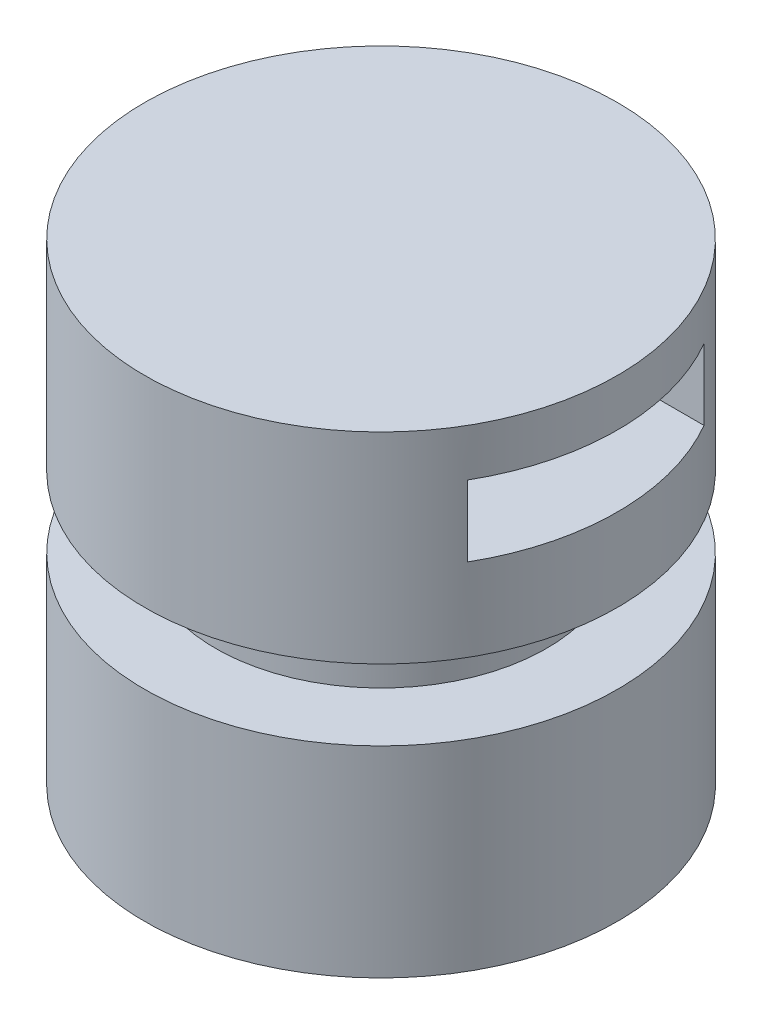
ISO-10303-21;
HEADER;
FILE_DESCRIPTION(('STEP AP214'),'2;1');
FILE_NAME('part.step','',(''),(''),'','','');
FILE_SCHEMA(('AUTOMOTIVE_DESIGN { 1 0 10303 214 1 1 1 1 }'));
ENDSEC;
DATA;
#1=APPLICATION_CONTEXT('core data for automotive mechanical design processes');
#2=APPLICATION_PROTOCOL_DEFINITION('international standard','automotive_design',2000,#1);
#3=PRODUCT_CONTEXT('',#1,'mechanical');
#4=PRODUCT('Part','Part','',(#3));
#5=PRODUCT_RELATED_PRODUCT_CATEGORY('part','',(#4));
#6=PRODUCT_DEFINITION_FORMATION('','',#4);
#7=PRODUCT_DEFINITION_CONTEXT('part definition',#1,'design');
#8=PRODUCT_DEFINITION('design','',#6,#7);
#9=PRODUCT_DEFINITION_SHAPE('','',#8);
#10=(LENGTH_UNIT() NAMED_UNIT(*) SI_UNIT(.MILLI.,.METRE.));
#11=(NAMED_UNIT(*) PLANE_ANGLE_UNIT() SI_UNIT($,.RADIAN.));
#12=(NAMED_UNIT(*) SI_UNIT($,.STERADIAN.) SOLID_ANGLE_UNIT());
#13=UNCERTAINTY_MEASURE_WITH_UNIT(LENGTH_MEASURE(1.E-05),#10,'distance_accuracy_value','');
#14=(GEOMETRIC_REPRESENTATION_CONTEXT(3) GLOBAL_UNCERTAINTY_ASSIGNED_CONTEXT((#13)) GLOBAL_UNIT_ASSIGNED_CONTEXT((#10,
#11,#12)) REPRESENTATION_CONTEXT('',''));
#15=CARTESIAN_POINT('',(0.,0.,0.));
#16=DIRECTION('',(0.,0.,1.));
#17=DIRECTION('',(1.,0.,0.));
#18=AXIS2_PLACEMENT_3D('',#15,#16,#17);
#19=CARTESIAN_POINT('',(0.,200.,0.));
#20=DIRECTION('',(0.,1.,0.));
#21=DIRECTION('',(0.,0.,1.));
#22=AXIS2_PLACEMENT_3D('',#19,#20,#21);
#23=PLANE('',#22);
#24=CARTESIAN_POINT('',(0.,200.,0.));
#25=DIRECTION('',(0.,-1.,0.));
#26=DIRECTION('',(0.,0.,-1.));
#27=AXIS2_PLACEMENT_3D('',#24,#25,#26);
#28=CIRCLE('',#27,100.);
#29=CARTESIAN_POINT('',(0.,200.,-100.));
#30=VERTEX_POINT('',#29);
#31=EDGE_CURVE('E113',#30,#30,#28,.T.);
#32=ORIENTED_EDGE('',*,*,#31,.F.);
#33=EDGE_LOOP('',(#32));
#34=FACE_BOUND('',#33,.T.);
#35=ADVANCED_FACE('F33',(#34),#23,.T.);
#36=CARTESIAN_POINT('',(0.,0.,0.));
#37=DIRECTION('',(0.,-1.,0.));
#38=DIRECTION('',(0.,0.,-1.));
#39=AXIS2_PLACEMENT_3D('',#36,#37,#38);
#40=CYLINDRICAL_SURFACE('',#39,100.);
#41=CARTESIAN_POINT('',(0.,150.,0.));
#42=DIRECTION('',(0.,-1.,0.));
#43=DIRECTION('',(0.,0.,-1.));
#44=AXIS2_PLACEMENT_3D('',#41,#42,#43);
#45=CIRCLE('',#44,100.);
#46=CARTESIAN_POINT('',(-86.6025403784439,150.,-50.));
#47=VERTEX_POINT('',#46);
#48=CARTESIAN_POINT('',(-86.6025403784439,150.,50.));
#49=VERTEX_POINT('',#48);
#50=EDGE_CURVE('E72',#47,#49,#45,.F.);
#51=ORIENTED_EDGE('',*,*,#50,.F.);
#52=DIRECTION('',(0.,-1.,0.));
#53=VECTOR('',#52,1.);
#54=CARTESIAN_POINT('',(-86.6025403784438,0.,-50.));
#55=LINE('',#54,#53);
#56=CARTESIAN_POINT('',(-86.6025403784438,180.,-50.));
#57=VERTEX_POINT('',#56);
#58=EDGE_CURVE('E11',#57,#47,#55,.T.);
#59=ORIENTED_EDGE('',*,*,#58,.F.);
#60=CARTESIAN_POINT('',(0.,180.,0.));
#61=DIRECTION('',(0.,1.,0.));
#62=DIRECTION('',(0.,0.,1.));
#63=AXIS2_PLACEMENT_3D('',#60,#61,#62);
#64=CIRCLE('',#63,100.);
#65=CARTESIAN_POINT('',(-86.6025403784439,180.,50.));
#66=VERTEX_POINT('',#65);
#67=EDGE_CURVE('E55',#66,#57,#64,.F.);
#68=ORIENTED_EDGE('',*,*,#67,.F.);
#69=DIRECTION('',(0.,-1.,0.));
#70=VECTOR('',#69,1.);
#71=CARTESIAN_POINT('',(-86.6025403784439,0.,50.));
#72=LINE('',#71,#70);
#73=EDGE_CURVE('E40',#49,#66,#72,.F.);
#74=ORIENTED_EDGE('',*,*,#73,.F.);
#75=EDGE_LOOP('',(#51,#59,#68,#74));
#76=FACE_BOUND('',#75,.T.);
#77=CARTESIAN_POINT('',(86.6025403784439,150.,50.));
#78=VERTEX_POINT('',#77);
#79=CARTESIAN_POINT('',(86.6025403784439,150.,-50.));
#80=VERTEX_POINT('',#79);
#81=EDGE_CURVE('E81',#78,#80,#45,.F.);
#82=ORIENTED_EDGE('',*,*,#81,.F.);
#83=DIRECTION('',(0.,-1.,0.));
#84=VECTOR('',#83,1.);
#85=CARTESIAN_POINT('',(86.6025403784439,0.,50.));
#86=LINE('',#85,#84);
#87=CARTESIAN_POINT('',(86.6025403784439,180.,50.));
#88=VERTEX_POINT('',#87);
#89=EDGE_CURVE('E79',#88,#78,#86,.T.);
#90=ORIENTED_EDGE('',*,*,#89,.F.);
#91=CARTESIAN_POINT('',(86.6025403784438,180.,-50.));
#92=VERTEX_POINT('',#91);
#93=EDGE_CURVE('E47',#92,#88,#64,.F.);
#94=ORIENTED_EDGE('',*,*,#93,.F.);
#95=DIRECTION('',(0.,-1.,0.));
#96=VECTOR('',#95,1.);
#97=CARTESIAN_POINT('',(86.6025403784438,0.,-50.));
#98=LINE('',#97,#96);
#99=EDGE_CURVE('E116',#80,#92,#98,.F.);
#100=ORIENTED_EDGE('',*,*,#99,.F.);
#101=EDGE_LOOP('',(#82,#90,#94,#100));
#102=FACE_BOUND('',#101,.T.);
#103=CARTESIAN_POINT('',(0.,115.,0.));
#104=DIRECTION('',(0.,-1.,0.));
#105=DIRECTION('',(0.,0.,-1.));
#106=AXIS2_PLACEMENT_3D('',#103,#104,#105);
#107=CIRCLE('',#106,100.);
#108=CARTESIAN_POINT('',(0.,115.,-100.));
#109=VERTEX_POINT('',#108);
#110=EDGE_CURVE('E107',#109,#109,#107,.T.);
#111=ORIENTED_EDGE('',*,*,#110,.F.);
#112=EDGE_LOOP('',(#111));
#113=FACE_BOUND('',#112,.T.);
#114=ORIENTED_EDGE('',*,*,#31,.T.);
#115=EDGE_LOOP('',(#114));
#116=FACE_BOUND('',#115,.T.);
#117=ADVANCED_FACE('F73',(#76,#102,#113,#116),#40,.T.);
#118=CARTESIAN_POINT('',(0.,115.,0.));
#119=DIRECTION('',(0.,1.,0.));
#120=DIRECTION('',(0.,0.,1.));
#121=AXIS2_PLACEMENT_3D('',#118,#119,#120);
#122=PLANE('',#121);
#123=CARTESIAN_POINT('',(0.,115.,0.));
#124=DIRECTION('',(0.,-1.,0.));
#125=DIRECTION('',(0.,0.,-1.));
#126=AXIS2_PLACEMENT_3D('',#123,#124,#125);
#127=CIRCLE('',#126,70.);
#128=CARTESIAN_POINT('',(0.,115.,-70.));
#129=VERTEX_POINT('',#128);
#130=EDGE_CURVE('E104',#129,#129,#127,.T.);
#131=ORIENTED_EDGE('',*,*,#130,.F.);
#132=EDGE_LOOP('',(#131));
#133=FACE_BOUND('',#132,.T.);
#134=ORIENTED_EDGE('',*,*,#110,.T.);
#135=EDGE_LOOP('',(#134));
#136=FACE_BOUND('',#135,.T.);
#137=ADVANCED_FACE('F126',(#133,#136),#122,.F.);
#138=CARTESIAN_POINT('',(0.,200.,0.));
#139=DIRECTION('',(0.,-1.,0.));
#140=DIRECTION('',(0.,0.,-1.));
#141=AXIS2_PLACEMENT_3D('',#138,#139,#140);
#142=CYLINDRICAL_SURFACE('',#141,70.);
#143=ORIENTED_EDGE('',*,*,#130,.T.);
#144=EDGE_LOOP('',(#143));
#145=FACE_BOUND('',#144,.T.);
#146=CARTESIAN_POINT('',(0.,85.,0.));
#147=DIRECTION('',(0.,-1.,0.));
#148=DIRECTION('',(0.,0.,-1.));
#149=AXIS2_PLACEMENT_3D('',#146,#147,#148);
#150=CIRCLE('',#149,70.);
#151=CARTESIAN_POINT('',(0.,85.,-70.));
#152=VERTEX_POINT('',#151);
#153=EDGE_CURVE('E101',#152,#152,#150,.T.);
#154=ORIENTED_EDGE('',*,*,#153,.F.);
#155=EDGE_LOOP('',(#154));
#156=FACE_BOUND('',#155,.T.);
#157=ADVANCED_FACE('F148',(#145,#156),#142,.T.);
#158=CARTESIAN_POINT('',(0.,85.,0.));
#159=DIRECTION('',(0.,1.,0.));
#160=DIRECTION('',(0.,0.,1.));
#161=AXIS2_PLACEMENT_3D('',#158,#159,#160);
#162=PLANE('',#161);
#163=ORIENTED_EDGE('',*,*,#153,.T.);
#164=EDGE_LOOP('',(#163));
#165=FACE_BOUND('',#164,.T.);
#166=CARTESIAN_POINT('',(0.,85.,0.));
#167=DIRECTION('',(0.,-1.,0.));
#168=DIRECTION('',(0.,0.,-1.));
#169=AXIS2_PLACEMENT_3D('',#166,#167,#168);
#170=CIRCLE('',#169,100.);
#171=CARTESIAN_POINT('',(0.,85.,-100.));
#172=VERTEX_POINT('',#171);
#173=EDGE_CURVE('E98',#172,#172,#170,.T.);
#174=ORIENTED_EDGE('',*,*,#173,.F.);
#175=EDGE_LOOP('',(#174));
#176=FACE_BOUND('',#175,.T.);
#177=ADVANCED_FACE('F156',(#165,#176),#162,.T.);
#178=CARTESIAN_POINT('',(0.,0.,0.));
#179=DIRECTION('',(0.,-1.,0.));
#180=DIRECTION('',(0.,0.,-1.));
#181=AXIS2_PLACEMENT_3D('',#178,#179,#180);
#182=PLANE('',#181);
#183=CARTESIAN_POINT('',(0.,0.,0.));
#184=DIRECTION('',(0.,-1.,0.));
#185=DIRECTION('',(0.,0.,-1.));
#186=AXIS2_PLACEMENT_3D('',#183,#184,#185);
#187=CIRCLE('',#186,100.);
#188=CARTESIAN_POINT('',(0.,0.,-100.));
#189=VERTEX_POINT('',#188);
#190=EDGE_CURVE('E110',#189,#189,#187,.T.);
#191=ORIENTED_EDGE('',*,*,#190,.T.);
#192=EDGE_LOOP('',(#191));
#193=FACE_BOUND('',#192,.T.);
#194=ADVANCED_FACE('F164',(#193),#182,.T.);
#195=ORIENTED_EDGE('',*,*,#190,.F.);
#196=EDGE_LOOP('',(#195));
#197=FACE_BOUND('',#196,.T.);
#198=ORIENTED_EDGE('',*,*,#173,.T.);
#199=EDGE_LOOP('',(#198));
#200=FACE_BOUND('',#199,.T.);
#201=ADVANCED_FACE('F127',(#197,#200),#40,.T.);
#202=CARTESIAN_POINT('',(-100.,150.,50.));
#203=DIRECTION('',(0.,0.,1.));
#204=DIRECTION('',(0.,-1.,0.));
#205=AXIS2_PLACEMENT_3D('',#202,#203,#204);
#206=PLANE('',#205);
#207=ORIENTED_EDGE('',*,*,#73,.T.);
#208=DIRECTION('',(1.,0.,0.));
#209=VECTOR('',#208,1.);
#210=CARTESIAN_POINT('',(-100.,180.,50.));
#211=LINE('',#210,#209);
#212=EDGE_CURVE('E93',#66,#88,#211,.T.);
#213=ORIENTED_EDGE('',*,*,#212,.T.);
#214=ORIENTED_EDGE('',*,*,#89,.T.);
#215=DIRECTION('',(1.,0.,0.));
#216=VECTOR('',#215,1.);
#217=CARTESIAN_POINT('',(-100.,150.,50.));
#218=LINE('',#217,#216);
#219=EDGE_CURVE('E91',#49,#78,#218,.T.);
#220=ORIENTED_EDGE('',*,*,#219,.F.);
#221=EDGE_LOOP('',(#207,#213,#214,#220));
#222=FACE_BOUND('',#221,.T.);
#223=ADVANCED_FACE('F123',(#222),#206,.F.);
#224=CARTESIAN_POINT('',(-100.,180.,50.));
#225=DIRECTION('',(0.,1.,0.));
#226=DIRECTION('',(0.,0.,1.));
#227=AXIS2_PLACEMENT_3D('',#224,#225,#226);
#228=PLANE('',#227);
#229=ORIENTED_EDGE('',*,*,#212,.F.);
#230=ORIENTED_EDGE('',*,*,#67,.T.);
#231=DIRECTION('',(1.,0.,0.));
#232=VECTOR('',#231,1.);
#233=CARTESIAN_POINT('',(-100.,180.,-50.));
#234=LINE('',#233,#232);
#235=EDGE_CURVE('E89',#57,#92,#234,.T.);
#236=ORIENTED_EDGE('',*,*,#235,.T.);
#237=ORIENTED_EDGE('',*,*,#93,.T.);
#238=EDGE_LOOP('',(#229,#230,#236,#237));
#239=FACE_BOUND('',#238,.T.);
#240=ADVANCED_FACE('F121',(#239),#228,.F.);
#241=CARTESIAN_POINT('',(-100.,150.,-50.));
#242=DIRECTION('',(0.,0.,-1.));
#243=DIRECTION('',(0.,1.,0.));
#244=AXIS2_PLACEMENT_3D('',#241,#242,#243);
#245=PLANE('',#244);
#246=ORIENTED_EDGE('',*,*,#99,.T.);
#247=ORIENTED_EDGE('',*,*,#235,.F.);
#248=ORIENTED_EDGE('',*,*,#58,.T.);
#249=DIRECTION('',(1.,0.,0.));
#250=VECTOR('',#249,1.);
#251=CARTESIAN_POINT('',(-100.,150.,-50.));
#252=LINE('',#251,#250);
#253=EDGE_CURVE('E87',#47,#80,#252,.T.);
#254=ORIENTED_EDGE('',*,*,#253,.T.);
#255=EDGE_LOOP('',(#246,#247,#248,#254));
#256=FACE_BOUND('',#255,.T.);
#257=ADVANCED_FACE('F86',(#256),#245,.F.);
#258=CARTESIAN_POINT('',(-100.,150.,50.));
#259=DIRECTION('',(0.,-1.,0.));
#260=DIRECTION('',(0.,0.,-1.));
#261=AXIS2_PLACEMENT_3D('',#258,#259,#260);
#262=PLANE('',#261);
#263=ORIENTED_EDGE('',*,*,#253,.F.);
#264=ORIENTED_EDGE('',*,*,#50,.T.);
#265=ORIENTED_EDGE('',*,*,#219,.T.);
#266=ORIENTED_EDGE('',*,*,#81,.T.);
#267=EDGE_LOOP('',(#263,#264,#265,#266));
#268=FACE_BOUND('',#267,.T.);
#269=ADVANCED_FACE('F90',(#268),#262,.F.);
#270=CLOSED_SHELL('',(#35,#117,#137,#157,#177,#194,#201,#223,#240,#257,#269));
#271=MANIFOLD_SOLID_BREP('B2',#270);
#272=ADVANCED_BREP_SHAPE_REPRESENTATION('',(#18,#271),#14);
#273=SHAPE_DEFINITION_REPRESENTATION(#9,#272);
ENDSEC;
END-ISO-10303-21;
